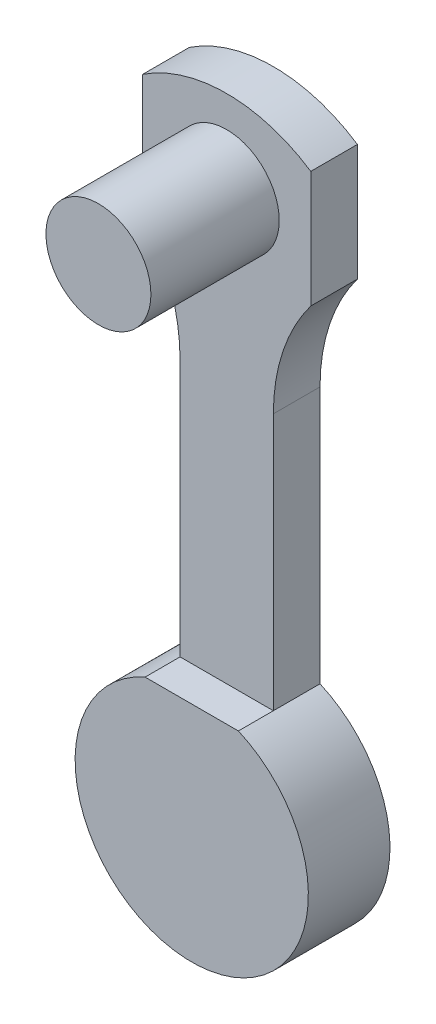
ISO-10303-21;
HEADER;
FILE_DESCRIPTION(('STEP AP214'),'2;1');
FILE_NAME('part.step','',(''),(''),'','','');
FILE_SCHEMA(('AUTOMOTIVE_DESIGN { 1 0 10303 214 1 1 1 1 }'));
ENDSEC;
DATA;
#1=APPLICATION_CONTEXT('core data for automotive mechanical design processes');
#2=APPLICATION_PROTOCOL_DEFINITION('international standard','automotive_design',2000,#1);
#3=PRODUCT_CONTEXT('',#1,'mechanical');
#4=PRODUCT('Part','Part','',(#3));
#5=PRODUCT_RELATED_PRODUCT_CATEGORY('part','',(#4));
#6=PRODUCT_DEFINITION_FORMATION('','',#4);
#7=PRODUCT_DEFINITION_CONTEXT('part definition',#1,'design');
#8=PRODUCT_DEFINITION('design','',#6,#7);
#9=PRODUCT_DEFINITION_SHAPE('','',#8);
#10=(LENGTH_UNIT() NAMED_UNIT(*) SI_UNIT(.MILLI.,.METRE.));
#11=(NAMED_UNIT(*) PLANE_ANGLE_UNIT() SI_UNIT($,.RADIAN.));
#12=(NAMED_UNIT(*) SI_UNIT($,.STERADIAN.) SOLID_ANGLE_UNIT());
#13=UNCERTAINTY_MEASURE_WITH_UNIT(LENGTH_MEASURE(1.E-05),#10,'distance_accuracy_value','');
#14=(GEOMETRIC_REPRESENTATION_CONTEXT(3) GLOBAL_UNCERTAINTY_ASSIGNED_CONTEXT((#13)) GLOBAL_UNIT_ASSIGNED_CONTEXT((#10,
#11,#12)) REPRESENTATION_CONTEXT('',''));
#15=CARTESIAN_POINT('',(0.,0.,0.));
#16=DIRECTION('',(0.,0.,1.));
#17=DIRECTION('',(1.,0.,0.));
#18=AXIS2_PLACEMENT_3D('',#15,#16,#17);
#19=CARTESIAN_POINT('',(-19.7357430228009,33.8890713476784,-2.));
#20=DIRECTION('',(-1.,0.,0.));
#21=DIRECTION('',(0.,-1.,0.));
#22=AXIS2_PLACEMENT_3D('',#19,#20,#21);
#23=PLANE('',#22);
#24=DIRECTION('',(0.,1.,0.));
#25=VECTOR('',#24,1.);
#26=CARTESIAN_POINT('',(-19.7357430228009,33.8890713476784,2.));
#27=LINE('',#26,#25);
#28=CARTESIAN_POINT('',(-19.7357430228009,33.8890713476784,2.));
#29=VERTEX_POINT('',#28);
#30=CARTESIAN_POINT('',(-19.7357430228009,43.8890713476784,2.));
#31=VERTEX_POINT('',#30);
#32=EDGE_CURVE('E140',#29,#31,#27,.T.);
#33=ORIENTED_EDGE('',*,*,#32,.T.);
#34=DIRECTION('',(0.,0.,1.));
#35=VECTOR('',#34,1.);
#36=CARTESIAN_POINT('',(-19.7357430228009,43.8890713476784,-2.));
#37=LINE('',#36,#35);
#38=CARTESIAN_POINT('',(-19.7357430228009,43.8890713476784,-2.));
#39=VERTEX_POINT('',#38);
#40=EDGE_CURVE('E144',#39,#31,#37,.T.);
#41=ORIENTED_EDGE('',*,*,#40,.F.);
#42=DIRECTION('',(0.,-1.,0.));
#43=VECTOR('',#42,1.);
#44=CARTESIAN_POINT('',(-19.7357430228009,33.8890713476784,-2.));
#45=LINE('',#44,#43);
#46=CARTESIAN_POINT('',(-19.7357430228009,33.8890713476784,-2.));
#47=VERTEX_POINT('',#46);
#48=EDGE_CURVE('E195',#39,#47,#45,.T.);
#49=ORIENTED_EDGE('',*,*,#48,.T.);
#50=DIRECTION('',(0.,0.,1.));
#51=VECTOR('',#50,1.);
#52=CARTESIAN_POINT('',(-19.7357430228009,33.8890713476784,-2.));
#53=LINE('',#52,#51);
#54=EDGE_CURVE('E68',#47,#29,#53,.T.);
#55=ORIENTED_EDGE('',*,*,#54,.T.);
#56=EDGE_LOOP('',(#33,#41,#49,#55));
#57=FACE_BOUND('',#56,.T.);
#58=ADVANCED_FACE('F44',(#57),#23,.T.);
#59=CARTESIAN_POINT('',(-5.32361124743637,43.8890713476784,-2.));
#60=DIRECTION('',(1.,0.,0.));
#61=DIRECTION('',(0.,1.,0.));
#62=AXIS2_PLACEMENT_3D('',#59,#60,#61);
#63=PLANE('',#62);
#64=DIRECTION('',(0.,0.,1.));
#65=VECTOR('',#64,1.);
#66=CARTESIAN_POINT('',(-5.32361124743637,43.8890713476784,-2.));
#67=LINE('',#66,#65);
#68=CARTESIAN_POINT('',(-5.32361124743637,43.8890713476784,-2.));
#69=VERTEX_POINT('',#68);
#70=CARTESIAN_POINT('',(-5.32361124743637,43.8890713476784,2.));
#71=VERTEX_POINT('',#70);
#72=EDGE_CURVE('E168',#69,#71,#67,.T.);
#73=ORIENTED_EDGE('',*,*,#72,.T.);
#74=DIRECTION('',(0.,-1.,0.));
#75=VECTOR('',#74,1.);
#76=CARTESIAN_POINT('',(-5.32361124743637,43.8890713476784,2.));
#77=LINE('',#76,#75);
#78=CARTESIAN_POINT('',(-5.32361124743637,33.8890713476784,2.));
#79=VERTEX_POINT('',#78);
#80=EDGE_CURVE('E156',#71,#79,#77,.T.);
#81=ORIENTED_EDGE('',*,*,#80,.T.);
#82=DIRECTION('',(0.,0.,1.));
#83=VECTOR('',#82,1.);
#84=CARTESIAN_POINT('',(-5.32361124743637,33.8890713476784,-2.));
#85=LINE('',#84,#83);
#86=CARTESIAN_POINT('',(-5.32361124743637,33.8890713476784,-2.));
#87=VERTEX_POINT('',#86);
#88=EDGE_CURVE('E173',#87,#79,#85,.T.);
#89=ORIENTED_EDGE('',*,*,#88,.F.);
#90=DIRECTION('',(0.,1.,0.));
#91=VECTOR('',#90,1.);
#92=CARTESIAN_POINT('',(-5.32361124743637,43.8890713476784,-2.));
#93=LINE('',#92,#91);
#94=EDGE_CURVE('E243',#87,#69,#93,.T.);
#95=ORIENTED_EDGE('',*,*,#94,.T.);
#96=EDGE_LOOP('',(#73,#81,#89,#95));
#97=FACE_BOUND('',#96,.T.);
#98=ADVANCED_FACE('F338',(#97),#63,.T.);
#99=CARTESIAN_POINT('',(-12.5296771351186,33.06906143907,-2.));
#100=DIRECTION('',(0.,0.,1.));
#101=DIRECTION('',(1.,0.,0.));
#102=AXIS2_PLACEMENT_3D('',#99,#100,#101);
#103=CYLINDRICAL_SURFACE('',#102,13.);
#104=ORIENTED_EDGE('',*,*,#40,.T.);
#105=CARTESIAN_POINT('',(-12.5296771351186,33.06906143907,2.));
#106=DIRECTION('',(0.,0.,1.));
#107=DIRECTION('',(1.,0.,0.));
#108=AXIS2_PLACEMENT_3D('',#105,#106,#107);
#109=CIRCLE('',#108,13.);
#110=EDGE_CURVE('E152',#31,#71,#109,.F.);
#111=ORIENTED_EDGE('',*,*,#110,.T.);
#112=ORIENTED_EDGE('',*,*,#72,.F.);
#113=CARTESIAN_POINT('',(-12.5296771351186,33.06906143907,-2.));
#114=DIRECTION('',(0.,0.,1.));
#115=DIRECTION('',(-1.,0.,0.));
#116=AXIS2_PLACEMENT_3D('',#113,#114,#115);
#117=CIRCLE('',#116,13.);
#118=EDGE_CURVE('E165',#69,#39,#117,.T.);
#119=ORIENTED_EDGE('',*,*,#118,.T.);
#120=EDGE_LOOP('',(#104,#111,#112,#119));
#121=FACE_BOUND('',#120,.T.);
#122=ADVANCED_FACE('F163',(#121),#103,.T.);
#123=CARTESIAN_POINT('',(-32.5296771351186,24.2809888163055,-2.));
#124=DIRECTION('',(0.,0.,1.));
#125=DIRECTION('',(1.,0.,0.));
#126=AXIS2_PLACEMENT_3D('',#123,#124,#125);
#127=CYLINDRICAL_SURFACE('',#126,16.);
#128=DIRECTION('',(0.,0.,1.));
#129=VECTOR('',#128,1.);
#130=CARTESIAN_POINT('',(-16.5296771351186,24.2809888163055,-2.));
#131=LINE('',#130,#129);
#132=CARTESIAN_POINT('',(-16.5296771351186,24.2809888163055,-2.));
#133=VERTEX_POINT('',#132);
#134=CARTESIAN_POINT('',(-16.5296771351186,24.2809888163055,2.));
#135=VERTEX_POINT('',#134);
#136=EDGE_CURVE('E192',#133,#135,#131,.T.);
#137=ORIENTED_EDGE('',*,*,#136,.T.);
#138=CARTESIAN_POINT('',(-32.5296771351186,24.2809888163055,2.));
#139=DIRECTION('',(0.,0.,1.));
#140=DIRECTION('',(1.,0.,0.));
#141=AXIS2_PLACEMENT_3D('',#138,#139,#140);
#142=CIRCLE('',#141,16.);
#143=EDGE_CURVE('E149',#135,#29,#142,.T.);
#144=ORIENTED_EDGE('',*,*,#143,.T.);
#145=ORIENTED_EDGE('',*,*,#54,.F.);
#146=CARTESIAN_POINT('',(-32.5296771351186,24.2809888163055,-2.));
#147=DIRECTION('',(0.,0.,-1.));
#148=DIRECTION('',(-1.,0.,0.));
#149=AXIS2_PLACEMENT_3D('',#146,#147,#148);
#150=CIRCLE('',#149,16.);
#151=EDGE_CURVE('E217',#47,#133,#150,.T.);
#152=ORIENTED_EDGE('',*,*,#151,.T.);
#153=EDGE_LOOP('',(#137,#144,#145,#152));
#154=FACE_BOUND('',#153,.T.);
#155=ADVANCED_FACE('F46',(#154),#127,.F.);
#156=CARTESIAN_POINT('',(7.47032286488138,24.2809888163055,-2.));
#157=DIRECTION('',(0.,0.,1.));
#158=DIRECTION('',(1.,0.,0.));
#159=AXIS2_PLACEMENT_3D('',#156,#157,#158);
#160=CYLINDRICAL_SURFACE('',#159,16.);
#161=ORIENTED_EDGE('',*,*,#88,.T.);
#162=CARTESIAN_POINT('',(7.47032286488138,24.2809888163055,2.));
#163=DIRECTION('',(0.,0.,1.));
#164=DIRECTION('',(1.,0.,0.));
#165=AXIS2_PLACEMENT_3D('',#162,#163,#164);
#166=CIRCLE('',#165,16.);
#167=CARTESIAN_POINT('',(-8.52967713511862,24.2809888163055,2.));
#168=VERTEX_POINT('',#167);
#169=EDGE_CURVE('E266',#79,#168,#166,.T.);
#170=ORIENTED_EDGE('',*,*,#169,.T.);
#171=DIRECTION('',(0.,0.,1.));
#172=VECTOR('',#171,1.);
#173=CARTESIAN_POINT('',(-8.52967713511862,24.2809888163055,-2.));
#174=LINE('',#173,#172);
#175=CARTESIAN_POINT('',(-8.52967713511862,24.2809888163055,-2.));
#176=VERTEX_POINT('',#175);
#177=EDGE_CURVE('E180',#176,#168,#174,.T.);
#178=ORIENTED_EDGE('',*,*,#177,.F.);
#179=CARTESIAN_POINT('',(7.47032286488138,24.2809888163055,-2.));
#180=DIRECTION('',(0.,0.,-1.));
#181=DIRECTION('',(1.,0.,0.));
#182=AXIS2_PLACEMENT_3D('',#179,#180,#181);
#183=CIRCLE('',#182,16.);
#184=EDGE_CURVE('E239',#176,#87,#183,.T.);
#185=ORIENTED_EDGE('',*,*,#184,.T.);
#186=EDGE_LOOP('',(#161,#170,#178,#185));
#187=FACE_BOUND('',#186,.T.);
#188=ADVANCED_FACE('F351',(#187),#160,.F.);
#189=CARTESIAN_POINT('',(-8.52967713511862,24.2809888163055,-2.));
#190=DIRECTION('',(1.,0.,0.));
#191=DIRECTION('',(0.,1.,0.));
#192=AXIS2_PLACEMENT_3D('',#189,#190,#191);
#193=PLANE('',#192);
#194=ORIENTED_EDGE('',*,*,#177,.T.);
#195=DIRECTION('',(0.,-1.,0.));
#196=VECTOR('',#195,1.);
#197=CARTESIAN_POINT('',(-8.52967713511862,24.2809888163055,2.));
#198=LINE('',#197,#196);
#199=CARTESIAN_POINT('',(-8.52967713511861,2.2309888163055,2.));
#200=VERTEX_POINT('',#199);
#201=EDGE_CURVE('E148',#168,#200,#198,.T.);
#202=ORIENTED_EDGE('',*,*,#201,.T.);
#203=DIRECTION('',(0.,0.,1.));
#204=VECTOR('',#203,1.);
#205=CARTESIAN_POINT('',(-8.52967713511862,2.23098881630551,-2.));
#206=LINE('',#205,#204);
#207=CARTESIAN_POINT('',(-8.52967713511862,2.23098881630551,-2.));
#208=VERTEX_POINT('',#207);
#209=EDGE_CURVE('E184',#208,#200,#206,.T.);
#210=ORIENTED_EDGE('',*,*,#209,.F.);
#211=DIRECTION('',(0.,1.,0.));
#212=VECTOR('',#211,1.);
#213=CARTESIAN_POINT('',(-8.52967713511862,24.2809888163055,-2.));
#214=LINE('',#213,#212);
#215=EDGE_CURVE('E235',#208,#176,#214,.T.);
#216=ORIENTED_EDGE('',*,*,#215,.T.);
#217=EDGE_LOOP('',(#194,#202,#210,#216));
#218=FACE_BOUND('',#217,.T.);
#219=ADVANCED_FACE('F354',(#218),#193,.T.);
#220=CARTESIAN_POINT('',(-16.5296771351186,24.2809888163055,-2.));
#221=DIRECTION('',(-1.,0.,0.));
#222=DIRECTION('',(0.,0.,1.));
#223=AXIS2_PLACEMENT_3D('',#220,#221,#222);
#224=PLANE('',#223);
#225=DIRECTION('',(0.,0.,1.));
#226=VECTOR('',#225,1.);
#227=CARTESIAN_POINT('',(-16.5296771351186,2.2309888163055,-2.));
#228=LINE('',#227,#226);
#229=CARTESIAN_POINT('',(-16.5296771351186,2.2309888163055,-2.));
#230=VERTEX_POINT('',#229);
#231=CARTESIAN_POINT('',(-16.5296771351186,2.2309888163055,2.));
#232=VERTEX_POINT('',#231);
#233=EDGE_CURVE('E188',#230,#232,#228,.T.);
#234=ORIENTED_EDGE('',*,*,#233,.T.);
#235=DIRECTION('',(0.,1.,0.));
#236=VECTOR('',#235,1.);
#237=CARTESIAN_POINT('',(-16.5296771351186,24.2809888163055,2.));
#238=LINE('',#237,#236);
#239=EDGE_CURVE('E11',#232,#135,#238,.T.);
#240=ORIENTED_EDGE('',*,*,#239,.T.);
#241=ORIENTED_EDGE('',*,*,#136,.F.);
#242=DIRECTION('',(0.,-1.,0.));
#243=VECTOR('',#242,1.);
#244=CARTESIAN_POINT('',(-16.5296771351186,24.2809888163055,-2.));
#245=LINE('',#244,#243);
#246=EDGE_CURVE('E222',#133,#230,#245,.T.);
#247=ORIENTED_EDGE('',*,*,#246,.T.);
#248=EDGE_LOOP('',(#234,#240,#241,#247));
#249=FACE_BOUND('',#248,.T.);
#250=ADVANCED_FACE('F255',(#249),#224,.T.);
#251=CARTESIAN_POINT('',(-32.5296771351186,24.2809888163055,5.));
#252=DIRECTION('',(0.,0.,-1.));
#253=DIRECTION('',(-1.,0.,0.));
#254=AXIS2_PLACEMENT_3D('',#251,#252,#253);
#255=PLANE('',#254);
#256=DIRECTION('',(1.,0.,0.));
#257=VECTOR('',#256,1.);
#258=CARTESIAN_POINT('',(-32.5296771351186,2.23098881630551,5.));
#259=LINE('',#258,#257);
#260=CARTESIAN_POINT('',(-16.5296771351186,2.23098881630551,5.));
#261=VERTEX_POINT('',#260);
#262=CARTESIAN_POINT('',(-8.52967713511862,2.23098881630551,5.));
#263=VERTEX_POINT('',#262);
#264=EDGE_CURVE('E53',#261,#263,#259,.T.);
#265=ORIENTED_EDGE('',*,*,#264,.F.);
#266=CARTESIAN_POINT('',(-12.5296771351186,-6.93416257360618,5.));
#267=DIRECTION('',(0.,0.,1.));
#268=DIRECTION('',(1.,0.,0.));
#269=AXIS2_PLACEMENT_3D('',#266,#267,#268);
#270=CIRCLE('',#269,10.);
#271=EDGE_CURVE('E211',#261,#263,#270,.T.);
#272=ORIENTED_EDGE('',*,*,#271,.T.);
#273=EDGE_LOOP('',(#265,#272));
#274=FACE_BOUND('',#273,.T.);
#275=ADVANCED_FACE('F215',(#274),#255,.F.);
#276=CARTESIAN_POINT('',(-12.5296771351186,-6.93416257360618,-2.));
#277=DIRECTION('',(0.,0.,1.));
#278=DIRECTION('',(1.,0.,0.));
#279=AXIS2_PLACEMENT_3D('',#276,#277,#278);
#280=CYLINDRICAL_SURFACE('',#279,10.);
#281=ORIENTED_EDGE('',*,*,#209,.T.);
#282=DIRECTION('',(0.,0.,1.));
#283=VECTOR('',#282,1.);
#284=CARTESIAN_POINT('',(-8.52967713511861,2.2309888163055,-2.));
#285=LINE('',#284,#283);
#286=EDGE_CURVE('E202',#200,#263,#285,.T.);
#287=ORIENTED_EDGE('',*,*,#286,.T.);
#288=ORIENTED_EDGE('',*,*,#271,.F.);
#289=DIRECTION('',(0.,0.,-1.));
#290=VECTOR('',#289,1.);
#291=CARTESIAN_POINT('',(-16.5296771351186,2.2309888163055,-2.));
#292=LINE('',#291,#290);
#293=EDGE_CURVE('E205',#261,#232,#292,.T.);
#294=ORIENTED_EDGE('',*,*,#293,.T.);
#295=ORIENTED_EDGE('',*,*,#233,.F.);
#296=CARTESIAN_POINT('',(-12.5296771351186,-6.93416257360618,-2.));
#297=DIRECTION('',(0.,0.,1.));
#298=DIRECTION('',(1.,0.,0.));
#299=AXIS2_PLACEMENT_3D('',#296,#297,#298);
#300=CIRCLE('',#299,10.);
#301=EDGE_CURVE('E232',#230,#208,#300,.T.);
#302=ORIENTED_EDGE('',*,*,#301,.T.);
#303=EDGE_LOOP('',(#281,#287,#288,#294,#295,#302));
#304=FACE_BOUND('',#303,.T.);
#305=ADVANCED_FACE('F210',(#304),#280,.T.);
#306=CARTESIAN_POINT('',(-32.5296771351186,24.2809888163055,-2.));
#307=DIRECTION('',(0.,0.,-1.));
#308=DIRECTION('',(-1.,0.,0.));
#309=AXIS2_PLACEMENT_3D('',#306,#307,#308);
#310=PLANE('',#309);
#311=DIRECTION('',(0.,-1.,0.));
#312=VECTOR('',#311,1.);
#313=CARTESIAN_POINT('',(-7.52967713511862,-1.93416257360618,-2.));
#314=LINE('',#313,#312);
#315=CARTESIAN_POINT('',(-7.52967713511862,-1.93416257360618,-2.));
#316=VERTEX_POINT('',#315);
#317=CARTESIAN_POINT('',(-7.52967713511862,-11.9341625736062,-2.));
#318=VERTEX_POINT('',#317);
#319=EDGE_CURVE('E60',#316,#318,#314,.T.);
#320=ORIENTED_EDGE('',*,*,#319,.F.);
#321=DIRECTION('',(1.,0.,0.));
#322=VECTOR('',#321,1.);
#323=CARTESIAN_POINT('',(-7.52967713511862,-1.93416257360618,-2.));
#324=LINE('',#323,#322);
#325=CARTESIAN_POINT('',(-17.5296771351186,-1.93416257360617,-2.));
#326=VERTEX_POINT('',#325);
#327=EDGE_CURVE('E277',#326,#316,#324,.T.);
#328=ORIENTED_EDGE('',*,*,#327,.F.);
#329=DIRECTION('',(0.,1.,0.));
#330=VECTOR('',#329,1.);
#331=CARTESIAN_POINT('',(-17.5296771351186,-1.93416257360617,-2.));
#332=LINE('',#331,#330);
#333=CARTESIAN_POINT('',(-17.5296771351186,-11.9341625736062,-2.));
#334=VERTEX_POINT('',#333);
#335=EDGE_CURVE('E296',#334,#326,#332,.T.);
#336=ORIENTED_EDGE('',*,*,#335,.F.);
#337=DIRECTION('',(-1.,0.,0.));
#338=VECTOR('',#337,1.);
#339=CARTESIAN_POINT('',(-7.52967713511862,-11.9341625736062,-2.));
#340=LINE('',#339,#338);
#341=EDGE_CURVE('E292',#318,#334,#340,.T.);
#342=ORIENTED_EDGE('',*,*,#341,.F.);
#343=EDGE_LOOP('',(#320,#328,#336,#342));
#344=FACE_BOUND('',#343,.T.);
#345=ORIENTED_EDGE('',*,*,#151,.F.);
#346=ORIENTED_EDGE('',*,*,#48,.F.);
#347=ORIENTED_EDGE('',*,*,#118,.F.);
#348=ORIENTED_EDGE('',*,*,#94,.F.);
#349=ORIENTED_EDGE('',*,*,#184,.F.);
#350=ORIENTED_EDGE('',*,*,#215,.F.);
#351=ORIENTED_EDGE('',*,*,#301,.F.);
#352=ORIENTED_EDGE('',*,*,#246,.F.);
#353=EDGE_LOOP('',(#345,#346,#347,#348,#349,#350,#351,#352));
#354=FACE_BOUND('',#353,.T.);
#355=ADVANCED_FACE('F250',(#344,#354),#310,.T.);
#356=CARTESIAN_POINT('',(-7.52967713511862,-1.93416257360618,4.));
#357=DIRECTION('',(1.,0.,0.));
#358=DIRECTION('',(0.,0.,-1.));
#359=AXIS2_PLACEMENT_3D('',#356,#357,#358);
#360=PLANE('',#359);
#361=ORIENTED_EDGE('',*,*,#319,.T.);
#362=DIRECTION('',(0.,0.,-1.));
#363=VECTOR('',#362,1.);
#364=CARTESIAN_POINT('',(-7.52967713511862,-11.9341625736062,4.));
#365=LINE('',#364,#363);
#366=CARTESIAN_POINT('',(-7.52967713511862,-11.9341625736062,4.));
#367=VERTEX_POINT('',#366);
#368=EDGE_CURVE('E289',#367,#318,#365,.T.);
#369=ORIENTED_EDGE('',*,*,#368,.F.);
#370=DIRECTION('',(0.,-1.,0.));
#371=VECTOR('',#370,1.);
#372=CARTESIAN_POINT('',(-7.52967713511862,-1.93416257360618,4.));
#373=LINE('',#372,#371);
#374=CARTESIAN_POINT('',(-7.52967713511862,-1.93416257360618,4.));
#375=VERTEX_POINT('',#374);
#376=EDGE_CURVE('E272',#375,#367,#373,.T.);
#377=ORIENTED_EDGE('',*,*,#376,.F.);
#378=DIRECTION('',(0.,0.,-1.));
#379=VECTOR('',#378,1.);
#380=CARTESIAN_POINT('',(-7.52967713511862,-1.93416257360618,4.));
#381=LINE('',#380,#379);
#382=EDGE_CURVE('E225',#375,#316,#381,.T.);
#383=ORIENTED_EDGE('',*,*,#382,.T.);
#384=EDGE_LOOP('',(#361,#369,#377,#383));
#385=FACE_BOUND('',#384,.T.);
#386=ADVANCED_FACE('F325',(#385),#360,.F.);
#387=CARTESIAN_POINT('',(-7.52967713511862,-1.93416257360618,4.));
#388=DIRECTION('',(0.,1.,0.));
#389=DIRECTION('',(-1.,0.,0.));
#390=AXIS2_PLACEMENT_3D('',#387,#388,#389);
#391=PLANE('',#390);
#392=ORIENTED_EDGE('',*,*,#327,.T.);
#393=ORIENTED_EDGE('',*,*,#382,.F.);
#394=DIRECTION('',(1.,0.,0.));
#395=VECTOR('',#394,1.);
#396=CARTESIAN_POINT('',(-7.52967713511862,-1.93416257360618,4.));
#397=LINE('',#396,#395);
#398=CARTESIAN_POINT('',(-17.5296771351186,-1.93416257360617,4.));
#399=VERTEX_POINT('',#398);
#400=EDGE_CURVE('E285',#399,#375,#397,.T.);
#401=ORIENTED_EDGE('',*,*,#400,.F.);
#402=DIRECTION('',(0.,0.,-1.));
#403=VECTOR('',#402,1.);
#404=CARTESIAN_POINT('',(-17.5296771351186,-1.93416257360617,4.));
#405=LINE('',#404,#403);
#406=EDGE_CURVE('E305',#399,#326,#405,.T.);
#407=ORIENTED_EDGE('',*,*,#406,.T.);
#408=EDGE_LOOP('',(#392,#393,#401,#407));
#409=FACE_BOUND('',#408,.T.);
#410=ADVANCED_FACE('F327',(#409),#391,.F.);
#411=CARTESIAN_POINT('',(-17.5296771351186,-1.93416257360617,4.));
#412=DIRECTION('',(-1.,0.,0.));
#413=DIRECTION('',(0.,0.,1.));
#414=AXIS2_PLACEMENT_3D('',#411,#412,#413);
#415=PLANE('',#414);
#416=ORIENTED_EDGE('',*,*,#335,.T.);
#417=ORIENTED_EDGE('',*,*,#406,.F.);
#418=DIRECTION('',(0.,1.,0.));
#419=VECTOR('',#418,1.);
#420=CARTESIAN_POINT('',(-17.5296771351186,-1.93416257360617,4.));
#421=LINE('',#420,#419);
#422=CARTESIAN_POINT('',(-17.5296771351186,-11.9341625736062,4.));
#423=VERTEX_POINT('',#422);
#424=EDGE_CURVE('E281',#423,#399,#421,.T.);
#425=ORIENTED_EDGE('',*,*,#424,.F.);
#426=DIRECTION('',(0.,0.,-1.));
#427=VECTOR('',#426,1.);
#428=CARTESIAN_POINT('',(-17.5296771351186,-11.9341625736062,4.));
#429=LINE('',#428,#427);
#430=EDGE_CURVE('E308',#423,#334,#429,.T.);
#431=ORIENTED_EDGE('',*,*,#430,.T.);
#432=EDGE_LOOP('',(#416,#417,#425,#431));
#433=FACE_BOUND('',#432,.T.);
#434=ADVANCED_FACE('F320',(#433),#415,.F.);
#435=CARTESIAN_POINT('',(-7.52967713511862,-11.9341625736062,4.));
#436=DIRECTION('',(0.,-1.,0.));
#437=DIRECTION('',(1.,0.,0.));
#438=AXIS2_PLACEMENT_3D('',#435,#436,#437);
#439=PLANE('',#438);
#440=ORIENTED_EDGE('',*,*,#341,.T.);
#441=ORIENTED_EDGE('',*,*,#430,.F.);
#442=DIRECTION('',(-1.,0.,0.));
#443=VECTOR('',#442,1.);
#444=CARTESIAN_POINT('',(-7.52967713511862,-11.9341625736062,4.));
#445=LINE('',#444,#443);
#446=EDGE_CURVE('E276',#367,#423,#445,.T.);
#447=ORIENTED_EDGE('',*,*,#446,.F.);
#448=ORIENTED_EDGE('',*,*,#368,.T.);
#449=EDGE_LOOP('',(#440,#441,#447,#448));
#450=FACE_BOUND('',#449,.T.);
#451=ADVANCED_FACE('F314',(#450),#439,.F.);
#452=CARTESIAN_POINT('',(0.,0.,4.));
#453=DIRECTION('',(0.,0.,-1.));
#454=DIRECTION('',(-1.,0.,0.));
#455=AXIS2_PLACEMENT_3D('',#452,#453,#454);
#456=PLANE('',#455);
#457=ORIENTED_EDGE('',*,*,#376,.T.);
#458=ORIENTED_EDGE('',*,*,#446,.T.);
#459=ORIENTED_EDGE('',*,*,#424,.T.);
#460=ORIENTED_EDGE('',*,*,#400,.T.);
#461=EDGE_LOOP('',(#457,#458,#459,#460));
#462=FACE_BOUND('',#461,.T.);
#463=ADVANCED_FACE('F324',(#462),#456,.T.);
#464=CARTESIAN_POINT('',(-31.5296771351186,2.2309888163055,2.));
#465=DIRECTION('',(0.,0.,1.));
#466=DIRECTION('',(1.,0.,0.));
#467=AXIS2_PLACEMENT_3D('',#464,#465,#466);
#468=PLANE('',#467);
#469=ORIENTED_EDGE('',*,*,#169,.F.);
#470=ORIENTED_EDGE('',*,*,#80,.F.);
#471=ORIENTED_EDGE('',*,*,#110,.F.);
#472=ORIENTED_EDGE('',*,*,#32,.F.);
#473=ORIENTED_EDGE('',*,*,#143,.F.);
#474=ORIENTED_EDGE('',*,*,#239,.F.);
#475=DIRECTION('',(1.,0.,0.));
#476=VECTOR('',#475,1.);
#477=CARTESIAN_POINT('',(-31.5296771351186,2.2309888163055,2.));
#478=LINE('',#477,#476);
#479=EDGE_CURVE('E160',#232,#200,#478,.T.);
#480=ORIENTED_EDGE('',*,*,#479,.T.);
#481=ORIENTED_EDGE('',*,*,#201,.F.);
#482=EDGE_LOOP('',(#469,#470,#471,#472,#473,#474,#480,#481));
#483=FACE_BOUND('',#482,.T.);
#484=CARTESIAN_POINT('',(-12.5296771351186,38.8890713476784,2.));
#485=DIRECTION('',(0.,0.,1.));
#486=DIRECTION('',(1.,0.,0.));
#487=AXIS2_PLACEMENT_3D('',#484,#485,#486);
#488=CIRCLE('',#487,4.50000000000001);
#489=CARTESIAN_POINT('',(-8.02967713511861,38.8890713476784,2.));
#490=VERTEX_POINT('',#489);
#491=EDGE_CURVE('E161',#490,#490,#488,.F.);
#492=ORIENTED_EDGE('',*,*,#491,.T.);
#493=EDGE_LOOP('',(#492));
#494=FACE_BOUND('',#493,.T.);
#495=ADVANCED_FACE('F153',(#483,#494),#468,.T.);
#496=CARTESIAN_POINT('',(-31.5296771351186,2.2309888163055,2.));
#497=DIRECTION('',(0.,1.,0.));
#498=DIRECTION('',(0.,0.,1.));
#499=AXIS2_PLACEMENT_3D('',#496,#497,#498);
#500=PLANE('',#499);
#501=ORIENTED_EDGE('',*,*,#479,.F.);
#502=ORIENTED_EDGE('',*,*,#293,.F.);
#503=ORIENTED_EDGE('',*,*,#264,.T.);
#504=ORIENTED_EDGE('',*,*,#286,.F.);
#505=EDGE_LOOP('',(#501,#502,#503,#504));
#506=FACE_BOUND('',#505,.T.);
#507=ADVANCED_FACE('F201',(#506),#500,.T.);
#508=CARTESIAN_POINT('',(-12.5296771351186,38.8890713476784,13.));
#509=DIRECTION('',(0.,0.,1.));
#510=DIRECTION('',(1.,0.,0.));
#511=AXIS2_PLACEMENT_3D('',#508,#509,#510);
#512=PLANE('',#511);
#513=CARTESIAN_POINT('',(-12.5296771351186,38.8890713476784,13.));
#514=DIRECTION('',(0.,0.,1.));
#515=DIRECTION('',(1.,0.,0.));
#516=AXIS2_PLACEMENT_3D('',#513,#514,#515);
#517=CIRCLE('',#516,4.50000000000001);
#518=CARTESIAN_POINT('',(-8.02967713511861,38.8890713476784,13.));
#519=VERTEX_POINT('',#518);
#520=EDGE_CURVE('E218',#519,#519,#517,.T.);
#521=ORIENTED_EDGE('',*,*,#520,.T.);
#522=EDGE_LOOP('',(#521));
#523=FACE_BOUND('',#522,.T.);
#524=ADVANCED_FACE('F370',(#523),#512,.T.);
#525=CARTESIAN_POINT('',(-12.5296771351186,38.8890713476784,13.));
#526=DIRECTION('',(0.,0.,-1.));
#527=DIRECTION('',(-1.,0.,0.));
#528=AXIS2_PLACEMENT_3D('',#525,#526,#527);
#529=CYLINDRICAL_SURFACE('',#528,4.50000000000001);
#530=ORIENTED_EDGE('',*,*,#520,.F.);
#531=EDGE_LOOP('',(#530));
#532=FACE_BOUND('',#531,.T.);
#533=ORIENTED_EDGE('',*,*,#491,.F.);
#534=EDGE_LOOP('',(#533));
#535=FACE_BOUND('',#534,.T.);
#536=ADVANCED_FACE('F367',(#532,#535),#529,.T.);
#537=CLOSED_SHELL('',(#58,#98,#122,#155,#188,#219,#250,#275,#305,#355,#386,#410,#434,#451,#463,
#495,#507,#524,#536));
#538=MANIFOLD_SOLID_BREP('B2',#537);
#539=ADVANCED_BREP_SHAPE_REPRESENTATION('',(#18,#538),#14);
#540=SHAPE_DEFINITION_REPRESENTATION(#9,#539);
ENDSEC;
END-ISO-10303-21;
